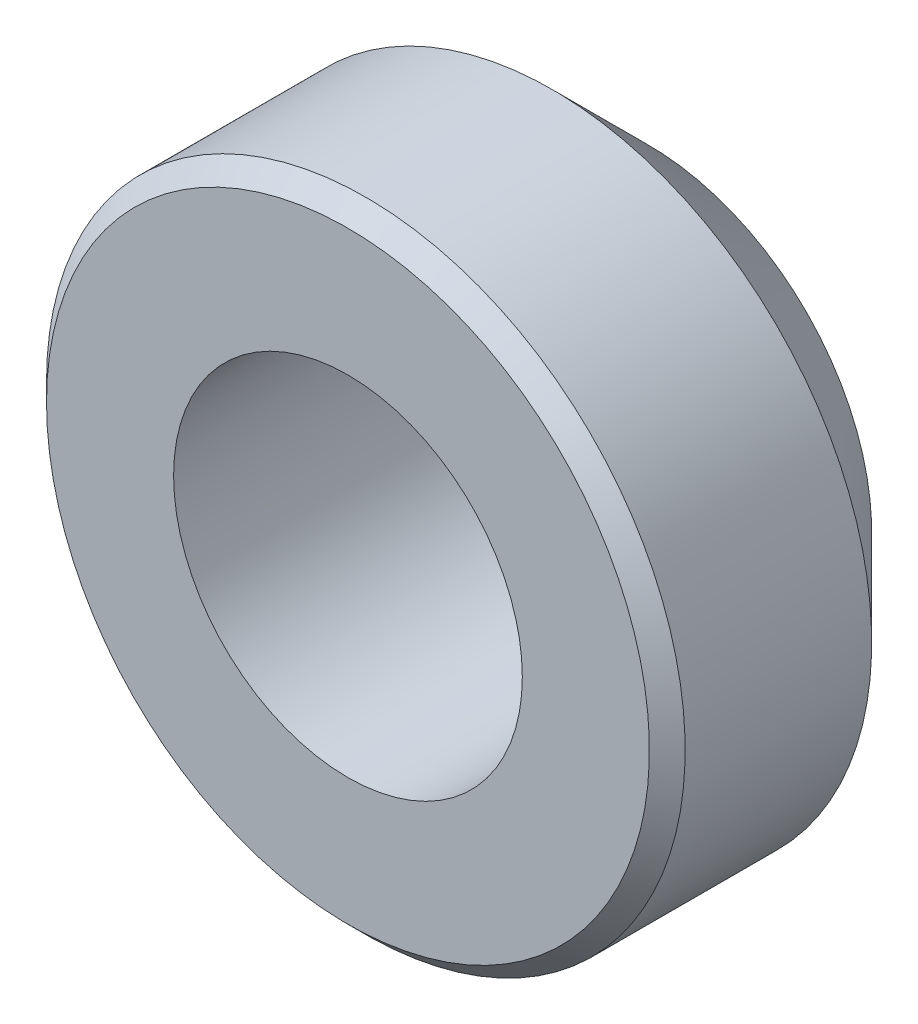
ISO-10303-21;
HEADER;
FILE_DESCRIPTION(('STEP AP214'),'2;1');
FILE_NAME('part.step','',(''),(''),'','','');
FILE_SCHEMA(('AUTOMOTIVE_DESIGN { 1 0 10303 214 1 1 1 1 }'));
ENDSEC;
DATA;
#1=APPLICATION_CONTEXT('core data for automotive mechanical design processes');
#2=APPLICATION_PROTOCOL_DEFINITION('international standard','automotive_design',2000,#1);
#3=PRODUCT_CONTEXT('',#1,'mechanical');
#4=PRODUCT('Part','Part','',(#3));
#5=PRODUCT_RELATED_PRODUCT_CATEGORY('part','',(#4));
#6=PRODUCT_DEFINITION_FORMATION('','',#4);
#7=PRODUCT_DEFINITION_CONTEXT('part definition',#1,'design');
#8=PRODUCT_DEFINITION('design','',#6,#7);
#9=PRODUCT_DEFINITION_SHAPE('','',#8);
#10=(LENGTH_UNIT() NAMED_UNIT(*) SI_UNIT(.MILLI.,.METRE.));
#11=(NAMED_UNIT(*) PLANE_ANGLE_UNIT() SI_UNIT($,.RADIAN.));
#12=(NAMED_UNIT(*) SI_UNIT($,.STERADIAN.) SOLID_ANGLE_UNIT());
#13=UNCERTAINTY_MEASURE_WITH_UNIT(LENGTH_MEASURE(1.E-05),#10,'distance_accuracy_value','');
#14=(GEOMETRIC_REPRESENTATION_CONTEXT(3) GLOBAL_UNCERTAINTY_ASSIGNED_CONTEXT((#13)) GLOBAL_UNIT_ASSIGNED_CONTEXT((#10,
#11,#12)) REPRESENTATION_CONTEXT('',''));
#15=CARTESIAN_POINT('',(0.,0.,0.));
#16=DIRECTION('',(0.,0.,1.));
#17=DIRECTION('',(1.,0.,0.));
#18=AXIS2_PLACEMENT_3D('',#15,#16,#17);
#19=CARTESIAN_POINT('',(0.,0.,0.));
#20=DIRECTION('',(0.,0.,-1.));
#21=DIRECTION('',(-1.,0.,0.));
#22=AXIS2_PLACEMENT_3D('',#19,#20,#21);
#23=PLANE('',#22);
#24=CARTESIAN_POINT('',(0.,0.,0.));
#25=DIRECTION('',(0.,0.,-1.));
#26=DIRECTION('',(-1.,0.,0.));
#27=AXIS2_PLACEMENT_3D('',#24,#25,#26);
#28=CIRCLE('',#27,2.9972);
#29=CARTESIAN_POINT('',(-2.9972,0.,0.));
#30=VERTEX_POINT('',#29);
#31=EDGE_CURVE('E10',#30,#30,#28,.F.);
#32=ORIENTED_EDGE('',*,*,#31,.T.);
#33=EDGE_LOOP('',(#32));
#34=FACE_BOUND('',#33,.T.);
#35=CARTESIAN_POINT('',(0.,0.,0.));
#36=DIRECTION('',(0.,0.,-1.));
#37=DIRECTION('',(-1.,0.,0.));
#38=AXIS2_PLACEMENT_3D('',#35,#36,#37);
#39=CIRCLE('',#38,1.73355);
#40=CARTESIAN_POINT('',(-1.73355,0.,0.));
#41=VERTEX_POINT('',#40);
#42=EDGE_CURVE('E51',#41,#41,#39,.T.);
#43=ORIENTED_EDGE('',*,*,#42,.T.);
#44=EDGE_LOOP('',(#43));
#45=FACE_BOUND('',#44,.T.);
#46=ADVANCED_FACE('F31',(#34,#45),#23,.F.);
#47=CARTESIAN_POINT('',(0.,0.,0.));
#48=DIRECTION('',(0.,0.,-1.));
#49=DIRECTION('',(-1.,0.,0.));
#50=AXIS2_PLACEMENT_3D('',#47,#48,#49);
#51=CYLINDRICAL_SURFACE('',#50,3.175);
#52=CARTESIAN_POINT('',(0.,0.,-0.177800000000001));
#53=DIRECTION('',(0.,0.,-1.));
#54=DIRECTION('',(-1.,0.,0.));
#55=AXIS2_PLACEMENT_3D('',#52,#53,#54);
#56=CIRCLE('',#55,3.175);
#57=CARTESIAN_POINT('',(-3.175,0.,-0.177800000000001));
#58=VERTEX_POINT('',#57);
#59=EDGE_CURVE('E38',#58,#58,#56,.T.);
#60=ORIENTED_EDGE('',*,*,#59,.T.);
#61=EDGE_LOOP('',(#60));
#62=FACE_BOUND('',#61,.T.);
#63=CARTESIAN_POINT('',(0.,0.,-2.032));
#64=DIRECTION('',(0.,0.,-1.));
#65=DIRECTION('',(-1.,0.,0.));
#66=AXIS2_PLACEMENT_3D('',#63,#64,#65);
#67=CIRCLE('',#66,3.175);
#68=CARTESIAN_POINT('',(-3.175,0.,-2.032));
#69=VERTEX_POINT('',#68);
#70=EDGE_CURVE('E42',#69,#69,#67,.T.);
#71=ORIENTED_EDGE('',*,*,#70,.F.);
#72=EDGE_LOOP('',(#71));
#73=FACE_BOUND('',#72,.T.);
#74=ADVANCED_FACE('F74',(#62,#73),#51,.T.);
#75=CARTESIAN_POINT('',(0.,0.,-2.032));
#76=DIRECTION('',(0.,0.,1.));
#77=DIRECTION('',(1.,0.,0.));
#78=AXIS2_PLACEMENT_3D('',#75,#76,#77);
#79=CONICAL_SURFACE('',#78,3.175,0.785398163397451);
#80=CARTESIAN_POINT('',(0.,0.,-2.9845));
#81=DIRECTION('',(0.,0.,-1.));
#82=DIRECTION('',(-1.,0.,0.));
#83=AXIS2_PLACEMENT_3D('',#80,#81,#82);
#84=CIRCLE('',#83,2.2225);
#85=CARTESIAN_POINT('',(-2.2225,0.,-2.9845));
#86=VERTEX_POINT('',#85);
#87=EDGE_CURVE('E46',#86,#86,#84,.T.);
#88=ORIENTED_EDGE('',*,*,#87,.F.);
#89=EDGE_LOOP('',(#88));
#90=FACE_BOUND('',#89,.T.);
#91=ORIENTED_EDGE('',*,*,#70,.T.);
#92=EDGE_LOOP('',(#91));
#93=FACE_BOUND('',#92,.T.);
#94=ADVANCED_FACE('F68',(#90,#93),#79,.T.);
#95=CARTESIAN_POINT('',(2.2225,0.,-2.9845));
#96=DIRECTION('',(0.,0.,1.));
#97=DIRECTION('',(1.,0.,0.));
#98=AXIS2_PLACEMENT_3D('',#95,#96,#97);
#99=PLANE('',#98);
#100=CARTESIAN_POINT('',(0.,0.,-2.9845));
#101=DIRECTION('',(0.,0.,-1.));
#102=DIRECTION('',(-1.,0.,0.));
#103=AXIS2_PLACEMENT_3D('',#100,#101,#102);
#104=CIRCLE('',#103,1.73355);
#105=CARTESIAN_POINT('',(-1.73355,0.,-2.9845));
#106=VERTEX_POINT('',#105);
#107=EDGE_CURVE('E52',#106,#106,#104,.T.);
#108=ORIENTED_EDGE('',*,*,#107,.F.);
#109=EDGE_LOOP('',(#108));
#110=FACE_BOUND('',#109,.T.);
#111=ORIENTED_EDGE('',*,*,#87,.T.);
#112=EDGE_LOOP('',(#111));
#113=FACE_BOUND('',#112,.T.);
#114=ADVANCED_FACE('F62',(#110,#113),#99,.F.);
#115=CARTESIAN_POINT('',(0.,0.,0.));
#116=DIRECTION('',(0.,0.,-1.));
#117=DIRECTION('',(-1.,0.,0.));
#118=AXIS2_PLACEMENT_3D('',#115,#116,#117);
#119=CYLINDRICAL_SURFACE('',#118,1.73355);
#120=ORIENTED_EDGE('',*,*,#42,.F.);
#121=EDGE_LOOP('',(#120));
#122=FACE_BOUND('',#121,.T.);
#123=ORIENTED_EDGE('',*,*,#107,.T.);
#124=EDGE_LOOP('',(#123));
#125=FACE_BOUND('',#124,.T.);
#126=ADVANCED_FACE('F59',(#122,#125),#119,.F.);
#127=CARTESIAN_POINT('',(0.,0.,-0.177800000000001));
#128=DIRECTION('',(0.,0.,-1.));
#129=DIRECTION('',(-1.,0.,0.));
#130=AXIS2_PLACEMENT_3D('',#127,#128,#129);
#131=CONICAL_SURFACE('',#130,3.175,0.785398163397452);
#132=ORIENTED_EDGE('',*,*,#31,.F.);
#133=EDGE_LOOP('',(#132));
#134=FACE_BOUND('',#133,.T.);
#135=ORIENTED_EDGE('',*,*,#59,.F.);
#136=EDGE_LOOP('',(#135));
#137=FACE_BOUND('',#136,.T.);
#138=ADVANCED_FACE('F33',(#134,#137),#131,.T.);
#139=CLOSED_SHELL('',(#46,#74,#94,#114,#126,#138));
#140=MANIFOLD_SOLID_BREP('B2',#139);
#141=ADVANCED_BREP_SHAPE_REPRESENTATION('',(#18,#140),#14);
#142=SHAPE_DEFINITION_REPRESENTATION(#9,#141);
ENDSEC;
END-ISO-10303-21;
